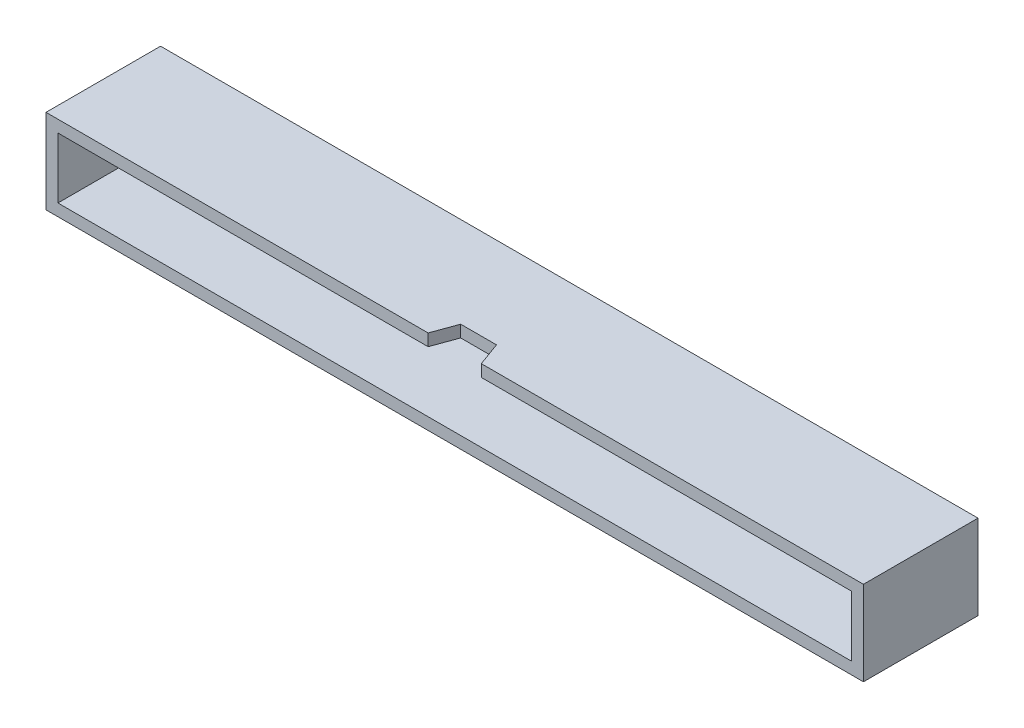
ISO-10303-21;
HEADER;
FILE_DESCRIPTION(('STEP AP214'),'2;1');
FILE_NAME('part.step','',(''),(''),'','','');
FILE_SCHEMA(('AUTOMOTIVE_DESIGN { 1 0 10303 214 1 1 1 1 }'));
ENDSEC;
DATA;
#1=APPLICATION_CONTEXT('core data for automotive mechanical design processes');
#2=APPLICATION_PROTOCOL_DEFINITION('international standard','automotive_design',2000,#1);
#3=PRODUCT_CONTEXT('',#1,'mechanical');
#4=PRODUCT('Part','Part','',(#3));
#5=PRODUCT_RELATED_PRODUCT_CATEGORY('part','',(#4));
#6=PRODUCT_DEFINITION_FORMATION('','',#4);
#7=PRODUCT_DEFINITION_CONTEXT('part definition',#1,'design');
#8=PRODUCT_DEFINITION('design','',#6,#7);
#9=PRODUCT_DEFINITION_SHAPE('','',#8);
#10=(LENGTH_UNIT() NAMED_UNIT(*) SI_UNIT(.MILLI.,.METRE.));
#11=(NAMED_UNIT(*) PLANE_ANGLE_UNIT() SI_UNIT($,.RADIAN.));
#12=(NAMED_UNIT(*) SI_UNIT($,.STERADIAN.) SOLID_ANGLE_UNIT());
#13=UNCERTAINTY_MEASURE_WITH_UNIT(LENGTH_MEASURE(1.E-05),#10,'distance_accuracy_value','');
#14=(GEOMETRIC_REPRESENTATION_CONTEXT(3) GLOBAL_UNCERTAINTY_ASSIGNED_CONTEXT((#13)) GLOBAL_UNIT_ASSIGNED_CONTEXT((#10,
#11,#12)) REPRESENTATION_CONTEXT('',''));
#15=CARTESIAN_POINT('',(0.,0.,0.));
#16=DIRECTION('',(0.,0.,1.));
#17=DIRECTION('',(1.,0.,0.));
#18=AXIS2_PLACEMENT_3D('',#15,#16,#17);
#19=CARTESIAN_POINT('',(33.48,3.54,7.60000000000002));
#20=DIRECTION('',(0.939692620785973,0.,-0.34202014332549));
#21=DIRECTION('',(-0.34202014332549,0.,-0.939692620785973));
#22=AXIS2_PLACEMENT_3D('',#19,#20,#21);
#23=PLANE('',#22);
#24=DIRECTION('',(0.,1.,0.));
#25=VECTOR('',#24,1.);
#26=CARTESIAN_POINT('',(34.207940468532,3.54,9.60000000000001));
#27=LINE('',#26,#25);
#28=CARTESIAN_POINT('',(34.207940468532,3.54,9.6));
#29=VERTEX_POINT('',#28);
#30=CARTESIAN_POINT('',(34.207940468532,2.53999998509884,9.6));
#31=VERTEX_POINT('',#30);
#32=EDGE_CURVE('E19',#29,#31,#27,.F.);
#33=ORIENTED_EDGE('',*,*,#32,.F.);
#34=DIRECTION('',(0.342020143325502,0.,0.939692620785969));
#35=VECTOR('',#34,1.);
#36=CARTESIAN_POINT('',(33.48,3.54,7.60000000000002));
#37=LINE('',#36,#35);
#38=CARTESIAN_POINT('',(33.48,3.54,7.60000000000002));
#39=VERTEX_POINT('',#38);
#40=EDGE_CURVE('E138',#39,#29,#37,.T.);
#41=ORIENTED_EDGE('',*,*,#40,.F.);
#42=DIRECTION('',(0.,1.,0.));
#43=VECTOR('',#42,1.);
#44=CARTESIAN_POINT('',(33.48,3.54,7.60000000000001));
#45=LINE('',#44,#43);
#46=CARTESIAN_POINT('',(33.48,2.53999998509884,7.60000000000002));
#47=VERTEX_POINT('',#46);
#48=EDGE_CURVE('E133',#39,#47,#45,.F.);
#49=ORIENTED_EDGE('',*,*,#48,.T.);
#50=DIRECTION('',(-0.342020143325502,0.,-0.939692620785969));
#51=VECTOR('',#50,1.);
#52=CARTESIAN_POINT('',(34.207940468532,2.53999998509884,9.6));
#53=LINE('',#52,#51);
#54=EDGE_CURVE('E135',#31,#47,#53,.T.);
#55=ORIENTED_EDGE('',*,*,#54,.F.);
#56=EDGE_LOOP('',(#33,#41,#49,#55));
#57=FACE_BOUND('',#56,.T.);
#58=ADVANCED_FACE('F16',(#57),#23,.F.);
#59=CARTESIAN_POINT('',(29.7520595314676,3.54,9.6));
#60=DIRECTION('',(-0.939692620785908,0.,-0.342020143325669));
#61=DIRECTION('',(-0.342020143325669,0.,0.939692620785908));
#62=AXIS2_PLACEMENT_3D('',#59,#60,#61);
#63=PLANE('',#62);
#64=DIRECTION('',(0.,1.,0.));
#65=VECTOR('',#64,1.);
#66=CARTESIAN_POINT('',(30.48,3.54,7.60000000000001));
#67=LINE('',#66,#65);
#68=CARTESIAN_POINT('',(30.48,2.53999998509884,7.60000000000001));
#69=VERTEX_POINT('',#68);
#70=CARTESIAN_POINT('',(30.48,3.54,7.60000000000001));
#71=VERTEX_POINT('',#70);
#72=EDGE_CURVE('E126',#69,#71,#67,.T.);
#73=ORIENTED_EDGE('',*,*,#72,.T.);
#74=DIRECTION('',(0.342020143325667,0.,-0.939692620785909));
#75=VECTOR('',#74,1.);
#76=CARTESIAN_POINT('',(29.7520595314676,3.54,9.6));
#77=LINE('',#76,#75);
#78=CARTESIAN_POINT('',(29.7520595314676,3.54,9.6));
#79=VERTEX_POINT('',#78);
#80=EDGE_CURVE('E189',#79,#71,#77,.T.);
#81=ORIENTED_EDGE('',*,*,#80,.F.);
#82=DIRECTION('',(0.,1.,0.));
#83=VECTOR('',#82,1.);
#84=CARTESIAN_POINT('',(29.7520595314676,3.54,9.6));
#85=LINE('',#84,#83);
#86=CARTESIAN_POINT('',(29.7520595314676,2.53999998509884,9.6));
#87=VERTEX_POINT('',#86);
#88=EDGE_CURVE('E169',#87,#79,#85,.T.);
#89=ORIENTED_EDGE('',*,*,#88,.F.);
#90=DIRECTION('',(-0.342020143325667,0.,0.939692620785909));
#91=VECTOR('',#90,1.);
#92=CARTESIAN_POINT('',(30.48,2.53999998509884,7.60000000000001));
#93=LINE('',#92,#91);
#94=EDGE_CURVE('E149',#69,#87,#93,.T.);
#95=ORIENTED_EDGE('',*,*,#94,.F.);
#96=EDGE_LOOP('',(#73,#81,#89,#95));
#97=FACE_BOUND('',#96,.T.);
#98=ADVANCED_FACE('F316',(#97),#63,.F.);
#99=CARTESIAN_POINT('',(30.48,3.54,7.60000000000001));
#100=DIRECTION('',(0.,0.,-1.));
#101=DIRECTION('',(-1.,0.,0.));
#102=AXIS2_PLACEMENT_3D('',#99,#100,#101);
#103=PLANE('',#102);
#104=ORIENTED_EDGE('',*,*,#48,.F.);
#105=DIRECTION('',(1.,0.,0.));
#106=VECTOR('',#105,1.);
#107=CARTESIAN_POINT('',(66.23,3.54,7.60000000000001));
#108=LINE('',#107,#106);
#109=EDGE_CURVE('E188',#71,#39,#108,.T.);
#110=ORIENTED_EDGE('',*,*,#109,.F.);
#111=ORIENTED_EDGE('',*,*,#72,.F.);
#112=DIRECTION('',(1.,0.,0.));
#113=VECTOR('',#112,1.);
#114=CARTESIAN_POINT('',(-1.26999998509884,2.53999998509884,7.60000000000002));
#115=LINE('',#114,#113);
#116=EDGE_CURVE('E144',#47,#69,#115,.F.);
#117=ORIENTED_EDGE('',*,*,#116,.F.);
#118=EDGE_LOOP('',(#104,#110,#111,#117));
#119=FACE_BOUND('',#118,.T.);
#120=ADVANCED_FACE('F145',(#119),#103,.F.);
#121=CARTESIAN_POINT('',(65.2299999850988,2.53999998509884,0.));
#122=DIRECTION('',(-1.,0.,0.));
#123=DIRECTION('',(0.,0.,1.));
#124=AXIS2_PLACEMENT_3D('',#121,#122,#123);
#125=PLANE('',#124);
#126=DIRECTION('',(0.,1.,0.));
#127=VECTOR('',#126,1.);
#128=CARTESIAN_POINT('',(65.2299999850988,0.,9.6));
#129=LINE('',#128,#127);
#130=CARTESIAN_POINT('',(65.2299999850988,2.53999998509884,9.6));
#131=VERTEX_POINT('',#130);
#132=CARTESIAN_POINT('',(65.2299999850988,-2.53999998509884,9.6));
#133=VERTEX_POINT('',#132);
#134=EDGE_CURVE('E221',#131,#133,#129,.F.);
#135=ORIENTED_EDGE('',*,*,#134,.F.);
#136=DIRECTION('',(0.,0.,-1.));
#137=VECTOR('',#136,1.);
#138=CARTESIAN_POINT('',(65.2299999850988,2.53999998509884,0.));
#139=LINE('',#138,#137);
#140=CARTESIAN_POINT('',(65.2299999850988,2.53999998509884,0.));
#141=VERTEX_POINT('',#140);
#142=EDGE_CURVE('E190',#141,#131,#139,.F.);
#143=ORIENTED_EDGE('',*,*,#142,.F.);
#144=DIRECTION('',(0.,1.,0.));
#145=VECTOR('',#144,1.);
#146=CARTESIAN_POINT('',(65.2299999850988,0.,0.));
#147=LINE('',#146,#145);
#148=CARTESIAN_POINT('',(65.2299999850988,-2.53999998509884,0.));
#149=VERTEX_POINT('',#148);
#150=EDGE_CURVE('E241',#141,#149,#147,.F.);
#151=ORIENTED_EDGE('',*,*,#150,.T.);
#152=DIRECTION('',(0.,0.,1.));
#153=VECTOR('',#152,1.);
#154=CARTESIAN_POINT('',(65.2299999850988,-2.53999998509884,0.));
#155=LINE('',#154,#153);
#156=EDGE_CURVE('E141',#133,#149,#155,.F.);
#157=ORIENTED_EDGE('',*,*,#156,.F.);
#158=EDGE_LOOP('',(#135,#143,#151,#157));
#159=FACE_BOUND('',#158,.T.);
#160=ADVANCED_FACE('F310',(#159),#125,.T.);
#161=CARTESIAN_POINT('',(65.2299999850988,-2.53999998509884,0.));
#162=DIRECTION('',(0.,1.,0.));
#163=DIRECTION('',(0.,0.,1.));
#164=AXIS2_PLACEMENT_3D('',#161,#162,#163);
#165=PLANE('',#164);
#166=DIRECTION('',(1.,0.,0.));
#167=VECTOR('',#166,1.);
#168=CARTESIAN_POINT('',(31.98,-2.53999998509884,9.6));
#169=LINE('',#168,#167);
#170=CARTESIAN_POINT('',(-1.26999998509884,-2.53999998509884,9.6));
#171=VERTEX_POINT('',#170);
#172=EDGE_CURVE('E215',#133,#171,#169,.F.);
#173=ORIENTED_EDGE('',*,*,#172,.F.);
#174=ORIENTED_EDGE('',*,*,#156,.T.);
#175=DIRECTION('',(1.,0.,0.));
#176=VECTOR('',#175,1.);
#177=CARTESIAN_POINT('',(31.98,-2.53999998509884,0.));
#178=LINE('',#177,#176);
#179=CARTESIAN_POINT('',(-1.26999998509884,-2.53999998509884,0.));
#180=VERTEX_POINT('',#179);
#181=EDGE_CURVE('E239',#149,#180,#178,.F.);
#182=ORIENTED_EDGE('',*,*,#181,.T.);
#183=DIRECTION('',(0.,0.,1.));
#184=VECTOR('',#183,1.);
#185=CARTESIAN_POINT('',(-1.26999998509884,-2.53999998509884,0.));
#186=LINE('',#185,#184);
#187=EDGE_CURVE('E155',#171,#180,#186,.F.);
#188=ORIENTED_EDGE('',*,*,#187,.F.);
#189=EDGE_LOOP('',(#173,#174,#182,#188));
#190=FACE_BOUND('',#189,.T.);
#191=ADVANCED_FACE('F306',(#190),#165,.T.);
#192=CARTESIAN_POINT('',(-1.26999998509884,-2.53999998509884,0.));
#193=DIRECTION('',(1.,0.,0.));
#194=DIRECTION('',(0.,1.,0.));
#195=AXIS2_PLACEMENT_3D('',#192,#193,#194);
#196=PLANE('',#195);
#197=DIRECTION('',(0.,1.,0.));
#198=VECTOR('',#197,1.);
#199=CARTESIAN_POINT('',(-1.26999998509884,0.,9.6));
#200=LINE('',#199,#198);
#201=CARTESIAN_POINT('',(-1.26999998509884,2.53999998509884,9.6));
#202=VERTEX_POINT('',#201);
#203=EDGE_CURVE('E208',#171,#202,#200,.T.);
#204=ORIENTED_EDGE('',*,*,#203,.F.);
#205=ORIENTED_EDGE('',*,*,#187,.T.);
#206=DIRECTION('',(0.,1.,0.));
#207=VECTOR('',#206,1.);
#208=CARTESIAN_POINT('',(-1.26999998509884,0.,0.));
#209=LINE('',#208,#207);
#210=CARTESIAN_POINT('',(-1.26999998509884,2.53999998509884,0.));
#211=VERTEX_POINT('',#210);
#212=EDGE_CURVE('E236',#180,#211,#209,.T.);
#213=ORIENTED_EDGE('',*,*,#212,.T.);
#214=DIRECTION('',(0.,0.,-1.));
#215=VECTOR('',#214,1.);
#216=CARTESIAN_POINT('',(-1.26999998509884,2.53999998509884,0.));
#217=LINE('',#216,#215);
#218=EDGE_CURVE('E195',#202,#211,#217,.T.);
#219=ORIENTED_EDGE('',*,*,#218,.F.);
#220=EDGE_LOOP('',(#204,#205,#213,#219));
#221=FACE_BOUND('',#220,.T.);
#222=ADVANCED_FACE('F303',(#221),#196,.T.);
#223=CARTESIAN_POINT('',(-1.26999998509884,2.53999998509884,0.));
#224=DIRECTION('',(0.,-1.,0.));
#225=DIRECTION('',(0.,0.,-1.));
#226=AXIS2_PLACEMENT_3D('',#223,#224,#225);
#227=PLANE('',#226);
#228=ORIENTED_EDGE('',*,*,#142,.T.);
#229=DIRECTION('',(1.,0.,0.));
#230=VECTOR('',#229,1.);
#231=CARTESIAN_POINT('',(31.98,2.53999998509884,9.6));
#232=LINE('',#231,#230);
#233=EDGE_CURVE('E153',#31,#131,#232,.T.);
#234=ORIENTED_EDGE('',*,*,#233,.F.);
#235=ORIENTED_EDGE('',*,*,#54,.T.);
#236=ORIENTED_EDGE('',*,*,#116,.T.);
#237=ORIENTED_EDGE('',*,*,#94,.T.);
#238=DIRECTION('',(1.,0.,0.));
#239=VECTOR('',#238,1.);
#240=CARTESIAN_POINT('',(31.98,2.53999998509884,9.6));
#241=LINE('',#240,#239);
#242=EDGE_CURVE('E203',#202,#87,#241,.T.);
#243=ORIENTED_EDGE('',*,*,#242,.F.);
#244=ORIENTED_EDGE('',*,*,#218,.T.);
#245=DIRECTION('',(1.,0.,0.));
#246=VECTOR('',#245,1.);
#247=CARTESIAN_POINT('',(31.98,2.53999998509884,0.));
#248=LINE('',#247,#246);
#249=EDGE_CURVE('E232',#211,#141,#248,.T.);
#250=ORIENTED_EDGE('',*,*,#249,.T.);
#251=EDGE_LOOP('',(#228,#234,#235,#236,#237,#243,#244,#250));
#252=FACE_BOUND('',#251,.T.);
#253=ADVANCED_FACE('F151',(#252),#227,.T.);
#254=CARTESIAN_POINT('',(66.23,3.54,0.));
#255=DIRECTION('',(0.,1.,0.));
#256=DIRECTION('',(0.,0.,1.));
#257=AXIS2_PLACEMENT_3D('',#254,#255,#256);
#258=PLANE('',#257);
#259=ORIENTED_EDGE('',*,*,#80,.T.);
#260=ORIENTED_EDGE('',*,*,#109,.T.);
#261=ORIENTED_EDGE('',*,*,#40,.T.);
#262=DIRECTION('',(1.,0.,0.));
#263=VECTOR('',#262,1.);
#264=CARTESIAN_POINT('',(31.98,3.54,9.6));
#265=LINE('',#264,#263);
#266=CARTESIAN_POINT('',(66.23,3.54,9.6));
#267=VERTEX_POINT('',#266);
#268=EDGE_CURVE('E183',#267,#29,#265,.F.);
#269=ORIENTED_EDGE('',*,*,#268,.F.);
#270=DIRECTION('',(0.,0.,-1.));
#271=VECTOR('',#270,1.);
#272=CARTESIAN_POINT('',(66.23,3.54,0.));
#273=LINE('',#272,#271);
#274=CARTESIAN_POINT('',(66.23,3.54,0.));
#275=VERTEX_POINT('',#274);
#276=EDGE_CURVE('E225',#275,#267,#273,.F.);
#277=ORIENTED_EDGE('',*,*,#276,.F.);
#278=DIRECTION('',(1.,0.,0.));
#279=VECTOR('',#278,1.);
#280=CARTESIAN_POINT('',(31.98,3.54,0.));
#281=LINE('',#280,#279);
#282=CARTESIAN_POINT('',(-2.27,3.54,0.));
#283=VERTEX_POINT('',#282);
#284=EDGE_CURVE('E244',#275,#283,#281,.F.);
#285=ORIENTED_EDGE('',*,*,#284,.T.);
#286=DIRECTION('',(0.,0.,1.));
#287=VECTOR('',#286,1.);
#288=CARTESIAN_POINT('',(-2.27,3.54,0.));
#289=LINE('',#288,#287);
#290=CARTESIAN_POINT('',(-2.27,3.54,9.6));
#291=VERTEX_POINT('',#290);
#292=EDGE_CURVE('E250',#291,#283,#289,.F.);
#293=ORIENTED_EDGE('',*,*,#292,.F.);
#294=DIRECTION('',(1.,0.,0.));
#295=VECTOR('',#294,1.);
#296=CARTESIAN_POINT('',(31.98,3.54,9.6));
#297=LINE('',#296,#295);
#298=EDGE_CURVE('E209',#79,#291,#297,.F.);
#299=ORIENTED_EDGE('',*,*,#298,.F.);
#300=EDGE_LOOP('',(#259,#260,#261,#269,#277,#285,#293,#299));
#301=FACE_BOUND('',#300,.T.);
#302=ADVANCED_FACE('F186',(#301),#258,.T.);
#303=CARTESIAN_POINT('',(31.98,0.,0.));
#304=DIRECTION('',(0.,0.,1.));
#305=DIRECTION('',(1.,0.,0.));
#306=AXIS2_PLACEMENT_3D('',#303,#304,#305);
#307=PLANE('',#306);
#308=ORIENTED_EDGE('',*,*,#212,.F.);
#309=ORIENTED_EDGE('',*,*,#181,.F.);
#310=ORIENTED_EDGE('',*,*,#150,.F.);
#311=ORIENTED_EDGE('',*,*,#249,.F.);
#312=EDGE_LOOP('',(#308,#309,#310,#311));
#313=FACE_BOUND('',#312,.T.);
#314=DIRECTION('',(0.,1.,0.));
#315=VECTOR('',#314,1.);
#316=CARTESIAN_POINT('',(-2.27,3.54,0.));
#317=LINE('',#316,#315);
#318=CARTESIAN_POINT('',(-2.27,-3.54,0.));
#319=VERTEX_POINT('',#318);
#320=EDGE_CURVE('E255',#283,#319,#317,.F.);
#321=ORIENTED_EDGE('',*,*,#320,.F.);
#322=ORIENTED_EDGE('',*,*,#284,.F.);
#323=DIRECTION('',(0.,1.,0.));
#324=VECTOR('',#323,1.);
#325=CARTESIAN_POINT('',(66.23,-3.54,0.));
#326=LINE('',#325,#324);
#327=CARTESIAN_POINT('',(66.23,-3.54,0.));
#328=VERTEX_POINT('',#327);
#329=EDGE_CURVE('E228',#328,#275,#326,.T.);
#330=ORIENTED_EDGE('',*,*,#329,.F.);
#331=DIRECTION('',(1.,0.,0.));
#332=VECTOR('',#331,1.);
#333=CARTESIAN_POINT('',(-2.27,-3.54,0.));
#334=LINE('',#333,#332);
#335=EDGE_CURVE('E253',#319,#328,#334,.T.);
#336=ORIENTED_EDGE('',*,*,#335,.F.);
#337=EDGE_LOOP('',(#321,#322,#330,#336));
#338=FACE_BOUND('',#337,.T.);
#339=ADVANCED_FACE('F280',(#313,#338),#307,.F.);
#340=CARTESIAN_POINT('',(66.23,-3.54,0.));
#341=DIRECTION('',(1.,0.,0.));
#342=DIRECTION('',(0.,0.,-1.));
#343=AXIS2_PLACEMENT_3D('',#340,#341,#342);
#344=PLANE('',#343);
#345=DIRECTION('',(0.,1.,0.));
#346=VECTOR('',#345,1.);
#347=CARTESIAN_POINT('',(66.23,0.,9.6));
#348=LINE('',#347,#346);
#349=CARTESIAN_POINT('',(66.23,-3.54,9.6));
#350=VERTEX_POINT('',#349);
#351=EDGE_CURVE('E212',#350,#267,#348,.T.);
#352=ORIENTED_EDGE('',*,*,#351,.F.);
#353=DIRECTION('',(0.,0.,-1.));
#354=VECTOR('',#353,1.);
#355=CARTESIAN_POINT('',(66.23,-3.54,0.));
#356=LINE('',#355,#354);
#357=EDGE_CURVE('E261',#328,#350,#356,.F.);
#358=ORIENTED_EDGE('',*,*,#357,.F.);
#359=ORIENTED_EDGE('',*,*,#329,.T.);
#360=ORIENTED_EDGE('',*,*,#276,.T.);
#361=EDGE_LOOP('',(#352,#358,#359,#360));
#362=FACE_BOUND('',#361,.T.);
#363=ADVANCED_FACE('F275',(#362),#344,.T.);
#364=CARTESIAN_POINT('',(31.98,0.,9.6));
#365=DIRECTION('',(0.,0.,1.));
#366=DIRECTION('',(1.,0.,0.));
#367=AXIS2_PLACEMENT_3D('',#364,#365,#366);
#368=PLANE('',#367);
#369=ORIENTED_EDGE('',*,*,#351,.T.);
#370=ORIENTED_EDGE('',*,*,#268,.T.);
#371=ORIENTED_EDGE('',*,*,#32,.T.);
#372=ORIENTED_EDGE('',*,*,#233,.T.);
#373=ORIENTED_EDGE('',*,*,#134,.T.);
#374=ORIENTED_EDGE('',*,*,#172,.T.);
#375=ORIENTED_EDGE('',*,*,#203,.T.);
#376=ORIENTED_EDGE('',*,*,#242,.T.);
#377=ORIENTED_EDGE('',*,*,#88,.T.);
#378=ORIENTED_EDGE('',*,*,#298,.T.);
#379=DIRECTION('',(0.,1.,0.));
#380=VECTOR('',#379,1.);
#381=CARTESIAN_POINT('',(-2.27,3.54,9.6));
#382=LINE('',#381,#380);
#383=CARTESIAN_POINT('',(-2.27,-3.54,9.6));
#384=VERTEX_POINT('',#383);
#385=EDGE_CURVE('E39',#384,#291,#382,.T.);
#386=ORIENTED_EDGE('',*,*,#385,.F.);
#387=DIRECTION('',(1.,0.,0.));
#388=VECTOR('',#387,1.);
#389=CARTESIAN_POINT('',(-2.27,-3.54,9.6));
#390=LINE('',#389,#388);
#391=EDGE_CURVE('E26',#350,#384,#390,.F.);
#392=ORIENTED_EDGE('',*,*,#391,.F.);
#393=EDGE_LOOP('',(#369,#370,#371,#372,#373,#374,#375,#376,#377,#378,#386,#392));
#394=FACE_BOUND('',#393,.T.);
#395=ADVANCED_FACE('F180',(#394),#368,.T.);
#396=CARTESIAN_POINT('',(-2.27,3.54,0.));
#397=DIRECTION('',(-1.,0.,0.));
#398=DIRECTION('',(0.,0.,1.));
#399=AXIS2_PLACEMENT_3D('',#396,#397,#398);
#400=PLANE('',#399);
#401=ORIENTED_EDGE('',*,*,#385,.T.);
#402=ORIENTED_EDGE('',*,*,#292,.T.);
#403=ORIENTED_EDGE('',*,*,#320,.T.);
#404=DIRECTION('',(0.,0.,-1.));
#405=VECTOR('',#404,1.);
#406=CARTESIAN_POINT('',(-2.27,-3.54,0.));
#407=LINE('',#406,#405);
#408=EDGE_CURVE('E11',#384,#319,#407,.T.);
#409=ORIENTED_EDGE('',*,*,#408,.F.);
#410=EDGE_LOOP('',(#401,#402,#403,#409));
#411=FACE_BOUND('',#410,.T.);
#412=ADVANCED_FACE('F282',(#411),#400,.T.);
#413=CARTESIAN_POINT('',(-2.27,-3.54,0.));
#414=DIRECTION('',(0.,-1.,0.));
#415=DIRECTION('',(0.,0.,-1.));
#416=AXIS2_PLACEMENT_3D('',#413,#414,#415);
#417=PLANE('',#416);
#418=ORIENTED_EDGE('',*,*,#391,.T.);
#419=ORIENTED_EDGE('',*,*,#408,.T.);
#420=ORIENTED_EDGE('',*,*,#335,.T.);
#421=ORIENTED_EDGE('',*,*,#357,.T.);
#422=EDGE_LOOP('',(#418,#419,#420,#421));
#423=FACE_BOUND('',#422,.T.);
#424=ADVANCED_FACE('F272',(#423),#417,.T.);
#425=CLOSED_SHELL('',(#58,#98,#120,#160,#191,#222,#253,#302,#339,#363,#395,#412,#424));
#426=MANIFOLD_SOLID_BREP('B1',#425);
#427=ADVANCED_BREP_SHAPE_REPRESENTATION('',(#18,#426),#14);
#428=SHAPE_DEFINITION_REPRESENTATION(#9,#427);
ENDSEC;
END-ISO-10303-21;
